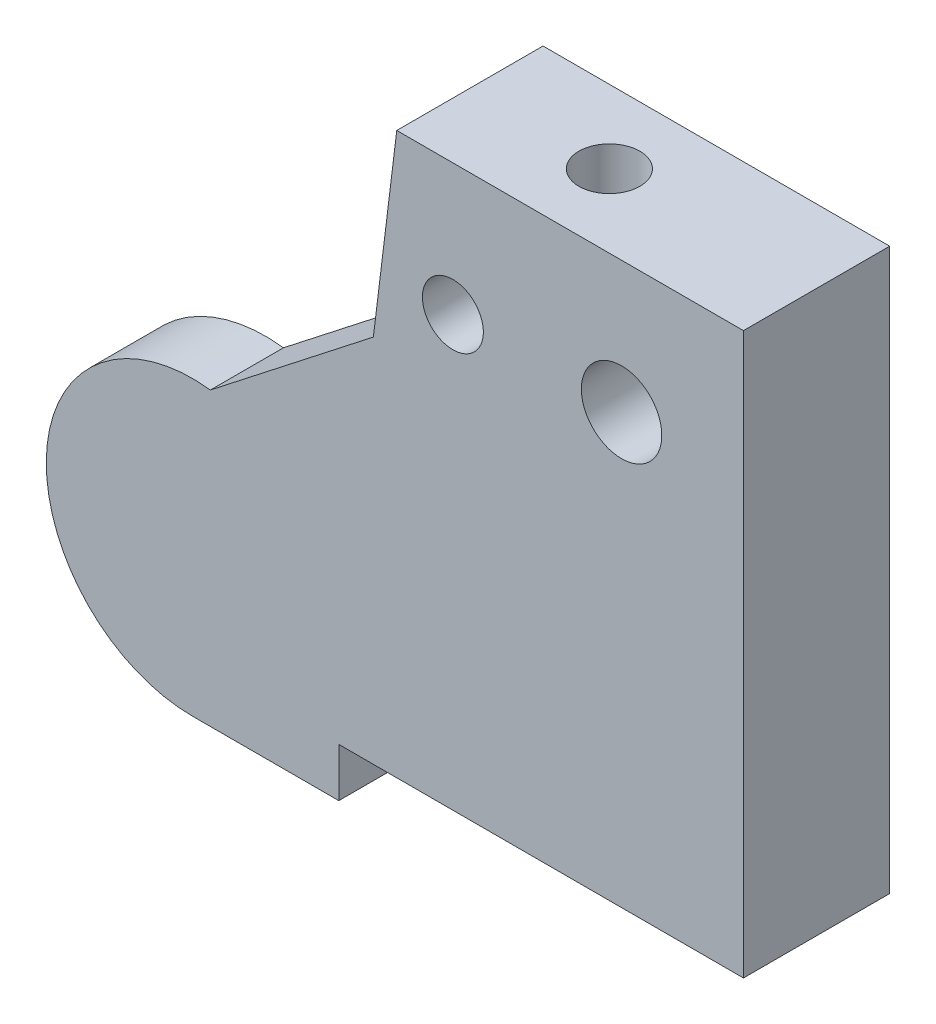
ISO-10303-21;
HEADER;
FILE_DESCRIPTION(('STEP AP214'),'2;1');
FILE_NAME('part.step','',(''),(''),'','','');
FILE_SCHEMA(('AUTOMOTIVE_DESIGN { 1 0 10303 214 1 1 1 1 }'));
ENDSEC;
DATA;
#1=APPLICATION_CONTEXT('core data for automotive mechanical design processes');
#2=APPLICATION_PROTOCOL_DEFINITION('international standard','automotive_design',2000,#1);
#3=PRODUCT_CONTEXT('',#1,'mechanical');
#4=PRODUCT('Part','Part','',(#3));
#5=PRODUCT_RELATED_PRODUCT_CATEGORY('part','',(#4));
#6=PRODUCT_DEFINITION_FORMATION('','',#4);
#7=PRODUCT_DEFINITION_CONTEXT('part definition',#1,'design');
#8=PRODUCT_DEFINITION('design','',#6,#7);
#9=PRODUCT_DEFINITION_SHAPE('','',#8);
#10=(LENGTH_UNIT() NAMED_UNIT(*) SI_UNIT(.MILLI.,.METRE.));
#11=(NAMED_UNIT(*) PLANE_ANGLE_UNIT() SI_UNIT($,.RADIAN.));
#12=(NAMED_UNIT(*) SI_UNIT($,.STERADIAN.) SOLID_ANGLE_UNIT());
#13=UNCERTAINTY_MEASURE_WITH_UNIT(LENGTH_MEASURE(1.E-05),#10,'distance_accuracy_value','');
#14=(GEOMETRIC_REPRESENTATION_CONTEXT(3) GLOBAL_UNCERTAINTY_ASSIGNED_CONTEXT((#13)) GLOBAL_UNIT_ASSIGNED_CONTEXT((#10,
#11,#12)) REPRESENTATION_CONTEXT('',''));
#15=CARTESIAN_POINT('',(0.,0.,0.));
#16=DIRECTION('',(0.,0.,1.));
#17=DIRECTION('',(1.,0.,0.));
#18=AXIS2_PLACEMENT_3D('',#15,#16,#17);
#19=CARTESIAN_POINT('',(0.,0.,9.));
#20=DIRECTION('',(0.,0.,-1.));
#21=DIRECTION('',(1.,0.,0.));
#22=AXIS2_PLACEMENT_3D('',#19,#20,#21);
#23=PLANE('',#22);
#24=CARTESIAN_POINT('',(-6.,4.,9.));
#25=DIRECTION('',(0.,0.,1.));
#26=DIRECTION('',(1.,0.,0.));
#27=AXIS2_PLACEMENT_3D('',#24,#25,#26);
#28=CIRCLE('',#27,6.);
#29=CARTESIAN_POINT('',(-6.,-2.,9.));
#30=VERTEX_POINT('',#29);
#31=CARTESIAN_POINT('',(-5.26878393956911,9.95527690984793,9.));
#32=VERTEX_POINT('',#31);
#33=EDGE_CURVE('E195',#30,#32,#28,.F.);
#34=ORIENTED_EDGE('',*,*,#33,.T.);
#35=DIRECTION('',(0.788010753606725,0.615661475325654,0.));
#36=VECTOR('',#35,1.);
#37=CARTESIAN_POINT('',(-5.26878393956915,9.95527690984794,9.));
#38=LINE('',#37,#36);
#39=CARTESIAN_POINT('',(1.41770903070971,15.179337759265,9.));
#40=VERTEX_POINT('',#39);
#41=EDGE_CURVE('E217',#32,#40,#38,.T.);
#42=ORIENTED_EDGE('',*,*,#41,.T.);
#43=DIRECTION('',(-0.121869343405148,-0.992546151641322,0.));
#44=VECTOR('',#43,1.);
#45=CARTESIAN_POINT('',(0.,3.6330242790971,9.));
#46=LINE('',#45,#44);
#47=CARTESIAN_POINT('',(0.,3.6330242790971,9.));
#48=VERTEX_POINT('',#47);
#49=EDGE_CURVE('E52',#40,#48,#46,.T.);
#50=ORIENTED_EDGE('',*,*,#49,.T.);
#51=DIRECTION('',(0.,-1.,0.));
#52=VECTOR('',#51,1.);
#53=CARTESIAN_POINT('',(0.,0.,9.));
#54=LINE('',#53,#52);
#55=CARTESIAN_POINT('',(0.,0.,9.));
#56=VERTEX_POINT('',#55);
#57=EDGE_CURVE('E202',#48,#56,#54,.T.);
#58=ORIENTED_EDGE('',*,*,#57,.T.);
#59=CARTESIAN_POINT('',(0.,-2.,9.));
#60=VERTEX_POINT('',#59);
#61=EDGE_CURVE('E201',#56,#60,#54,.T.);
#62=ORIENTED_EDGE('',*,*,#61,.T.);
#63=DIRECTION('',(-1.,0.,0.));
#64=VECTOR('',#63,1.);
#65=CARTESIAN_POINT('',(0.,-2.,9.));
#66=LINE('',#65,#64);
#67=EDGE_CURVE('E198',#60,#30,#66,.T.);
#68=ORIENTED_EDGE('',*,*,#67,.T.);
#69=EDGE_LOOP('',(#34,#42,#50,#58,#62,#68));
#70=FACE_BOUND('',#69,.T.);
#71=CARTESIAN_POINT('',(-6.,4.,9.));
#72=DIRECTION('',(0.,0.,-1.));
#73=DIRECTION('',(-1.,0.,0.));
#74=AXIS2_PLACEMENT_3D('',#71,#72,#73);
#75=CIRCLE('',#74,2.45);
#76=CARTESIAN_POINT('',(-8.45,4.,9.));
#77=VERTEX_POINT('',#76);
#78=EDGE_CURVE('E135',#77,#77,#75,.T.);
#79=ORIENTED_EDGE('',*,*,#78,.F.);
#80=EDGE_LOOP('',(#79));
#81=FACE_BOUND('',#80,.T.);
#82=ADVANCED_FACE('F37',(#70,#81),#23,.T.);
#83=CARTESIAN_POINT('',(0.,0.,12.));
#84=DIRECTION('',(0.,0.,-1.));
#85=DIRECTION('',(1.,0.,0.));
#86=AXIS2_PLACEMENT_3D('',#83,#84,#85);
#87=PLANE('',#86);
#88=CARTESIAN_POINT('',(11.6,17.6,12.));
#89=DIRECTION('',(0.,0.,-1.));
#90=DIRECTION('',(-1.,0.,0.));
#91=AXIS2_PLACEMENT_3D('',#88,#89,#90);
#92=CIRCLE('',#91,1.64999999999999);
#93=CARTESIAN_POINT('',(9.95,17.6,12.));
#94=VERTEX_POINT('',#93);
#95=EDGE_CURVE('E352',#94,#94,#92,.T.);
#96=ORIENTED_EDGE('',*,*,#95,.T.);
#97=EDGE_LOOP('',(#96));
#98=FACE_BOUND('',#97,.T.);
#99=DIRECTION('',(-0.121869343405148,-0.992546151641322,0.));
#100=VECTOR('',#99,1.);
#101=CARTESIAN_POINT('',(-0.439454060179395,0.0539581738161259,12.));
#102=LINE('',#101,#100);
#103=CARTESIAN_POINT('',(2.37796560990829,23.,12.));
#104=VERTEX_POINT('',#103);
#105=CARTESIAN_POINT('',(1.41770903070971,15.179337759265,12.));
#106=VERTEX_POINT('',#105);
#107=EDGE_CURVE('E153',#104,#106,#102,.T.);
#108=ORIENTED_EDGE('',*,*,#107,.T.);
#109=DIRECTION('',(-0.788010753606725,-0.615661475325654,0.));
#110=VECTOR('',#109,1.);
#111=CARTESIAN_POINT('',(-6.82685619046149,8.7379774551668,12.));
#112=LINE('',#111,#110);
#113=CARTESIAN_POINT('',(-5.26878393956911,9.95527690984793,12.));
#114=VERTEX_POINT('',#113);
#115=EDGE_CURVE('E219',#106,#114,#112,.T.);
#116=ORIENTED_EDGE('',*,*,#115,.T.);
#117=CARTESIAN_POINT('',(-6.,4.,12.));
#118=DIRECTION('',(0.,0.,1.));
#119=DIRECTION('',(1.,0.,0.));
#120=AXIS2_PLACEMENT_3D('',#117,#118,#119);
#121=CIRCLE('',#120,6.);
#122=CARTESIAN_POINT('',(-6.,-2.,12.));
#123=VERTEX_POINT('',#122);
#124=EDGE_CURVE('E194',#123,#114,#121,.F.);
#125=ORIENTED_EDGE('',*,*,#124,.F.);
#126=DIRECTION('',(-1.,0.,0.));
#127=VECTOR('',#126,1.);
#128=CARTESIAN_POINT('',(0.,-2.,12.));
#129=LINE('',#128,#127);
#130=CARTESIAN_POINT('',(0.,-2.,12.));
#131=VERTEX_POINT('',#130);
#132=EDGE_CURVE('E207',#131,#123,#129,.T.);
#133=ORIENTED_EDGE('',*,*,#132,.F.);
#134=DIRECTION('',(0.,-1.,0.));
#135=VECTOR('',#134,1.);
#136=CARTESIAN_POINT('',(0.,0.,12.));
#137=LINE('',#136,#135);
#138=CARTESIAN_POINT('',(0.,0.,12.));
#139=VERTEX_POINT('',#138);
#140=EDGE_CURVE('E199',#139,#131,#137,.T.);
#141=ORIENTED_EDGE('',*,*,#140,.F.);
#142=DIRECTION('',(1.,0.,0.));
#143=VECTOR('',#142,1.);
#144=CARTESIAN_POINT('',(0.,0.,12.));
#145=LINE('',#144,#143);
#146=CARTESIAN_POINT('',(16.6,0.,12.));
#147=VERTEX_POINT('',#146);
#148=EDGE_CURVE('E165',#139,#147,#145,.T.);
#149=ORIENTED_EDGE('',*,*,#148,.T.);
#150=DIRECTION('',(0.,1.,0.));
#151=VECTOR('',#150,1.);
#152=CARTESIAN_POINT('',(16.6,0.,12.));
#153=LINE('',#152,#151);
#154=CARTESIAN_POINT('',(16.6,23.,12.));
#155=VERTEX_POINT('',#154);
#156=EDGE_CURVE('E182',#147,#155,#153,.T.);
#157=ORIENTED_EDGE('',*,*,#156,.T.);
#158=DIRECTION('',(1.,0.,0.));
#159=VECTOR('',#158,1.);
#160=CARTESIAN_POINT('',(0.,23.,12.));
#161=LINE('',#160,#159);
#162=EDGE_CURVE('E171',#104,#155,#161,.T.);
#163=ORIENTED_EDGE('',*,*,#162,.F.);
#164=EDGE_LOOP('',(#108,#116,#125,#133,#141,#149,#157,#163));
#165=FACE_BOUND('',#164,.T.);
#166=CARTESIAN_POINT('',(4.68,17.61,12.));
#167=DIRECTION('',(0.,0.,-1.));
#168=DIRECTION('',(-1.,0.,0.));
#169=AXIS2_PLACEMENT_3D('',#166,#167,#168);
#170=CIRCLE('',#169,1.24999999999999);
#171=CARTESIAN_POINT('',(3.43000000000001,17.61,12.));
#172=VERTEX_POINT('',#171);
#173=EDGE_CURVE('E132',#172,#172,#170,.F.);
#174=ORIENTED_EDGE('',*,*,#173,.F.);
#175=EDGE_LOOP('',(#174));
#176=FACE_BOUND('',#175,.T.);
#177=ADVANCED_FACE('F238',(#98,#165,#176),#87,.F.);
#178=CARTESIAN_POINT('',(0.,0.,6.));
#179=DIRECTION('',(-1.,0.,0.));
#180=DIRECTION('',(0.,0.,-1.));
#181=AXIS2_PLACEMENT_3D('',#178,#179,#180);
#182=PLANE('',#181);
#183=DIRECTION('',(0.,0.,-1.));
#184=VECTOR('',#183,1.);
#185=CARTESIAN_POINT('',(0.,3.6330242790971,9.));
#186=LINE('',#185,#184);
#187=CARTESIAN_POINT('',(0.,3.6330242790971,6.));
#188=VERTEX_POINT('',#187);
#189=EDGE_CURVE('E162',#48,#188,#186,.T.);
#190=ORIENTED_EDGE('',*,*,#189,.T.);
#191=DIRECTION('',(0.,1.,0.));
#192=VECTOR('',#191,1.);
#193=CARTESIAN_POINT('',(0.,0.,6.));
#194=LINE('',#193,#192);
#195=CARTESIAN_POINT('',(0.,0.,6.));
#196=VERTEX_POINT('',#195);
#197=EDGE_CURVE('E176',#196,#188,#194,.T.);
#198=ORIENTED_EDGE('',*,*,#197,.F.);
#199=DIRECTION('',(0.,0.,1.));
#200=VECTOR('',#199,1.);
#201=CARTESIAN_POINT('',(0.,0.,6.));
#202=LINE('',#201,#200);
#203=EDGE_CURVE('E186',#196,#56,#202,.T.);
#204=ORIENTED_EDGE('',*,*,#203,.T.);
#205=ORIENTED_EDGE('',*,*,#57,.F.);
#206=EDGE_LOOP('',(#190,#198,#204,#205));
#207=FACE_BOUND('',#206,.T.);
#208=ADVANCED_FACE('F244',(#207),#182,.T.);
#209=CARTESIAN_POINT('',(0.,0.,9.));
#210=DIRECTION('',(1.,0.,0.));
#211=DIRECTION('',(0.,1.,0.));
#212=AXIS2_PLACEMENT_3D('',#209,#210,#211);
#213=PLANE('',#212);
#214=ORIENTED_EDGE('',*,*,#140,.T.);
#215=DIRECTION('',(0.,0.,1.));
#216=VECTOR('',#215,1.);
#217=CARTESIAN_POINT('',(0.,-2.,9.));
#218=LINE('',#217,#216);
#219=EDGE_CURVE('E204',#60,#131,#218,.T.);
#220=ORIENTED_EDGE('',*,*,#219,.F.);
#221=ORIENTED_EDGE('',*,*,#61,.F.);
#222=EDGE_CURVE('E179',#56,#139,#202,.T.);
#223=ORIENTED_EDGE('',*,*,#222,.T.);
#224=EDGE_LOOP('',(#214,#220,#221,#223));
#225=FACE_BOUND('',#224,.T.);
#226=ADVANCED_FACE('F252',(#225),#213,.T.);
#227=CARTESIAN_POINT('',(-6.,4.,9.));
#228=DIRECTION('',(0.,0.,1.));
#229=DIRECTION('',(-1.,0.,0.));
#230=AXIS2_PLACEMENT_3D('',#227,#228,#229);
#231=CYLINDRICAL_SURFACE('',#230,6.);
#232=ORIENTED_EDGE('',*,*,#124,.T.);
#233=DIRECTION('',(0.,0.,-1.));
#234=VECTOR('',#233,1.);
#235=CARTESIAN_POINT('',(-5.26878393956911,9.95527690984793,12.));
#236=LINE('',#235,#234);
#237=EDGE_CURVE('E155',#114,#32,#236,.T.);
#238=ORIENTED_EDGE('',*,*,#237,.T.);
#239=ORIENTED_EDGE('',*,*,#33,.F.);
#240=DIRECTION('',(0.,0.,1.));
#241=VECTOR('',#240,1.);
#242=CARTESIAN_POINT('',(-6.,-2.,9.));
#243=LINE('',#242,#241);
#244=EDGE_CURVE('E213',#30,#123,#243,.T.);
#245=ORIENTED_EDGE('',*,*,#244,.T.);
#246=EDGE_LOOP('',(#232,#238,#239,#245));
#247=FACE_BOUND('',#246,.T.);
#248=ADVANCED_FACE('F255',(#247),#231,.T.);
#249=CARTESIAN_POINT('',(0.,-2.,9.));
#250=DIRECTION('',(0.,-1.,0.));
#251=DIRECTION('',(1.,0.,0.));
#252=AXIS2_PLACEMENT_3D('',#249,#250,#251);
#253=PLANE('',#252);
#254=ORIENTED_EDGE('',*,*,#132,.T.);
#255=ORIENTED_EDGE('',*,*,#244,.F.);
#256=ORIENTED_EDGE('',*,*,#67,.F.);
#257=ORIENTED_EDGE('',*,*,#219,.T.);
#258=EDGE_LOOP('',(#254,#255,#256,#257));
#259=FACE_BOUND('',#258,.T.);
#260=ADVANCED_FACE('F257',(#259),#253,.T.);
#261=CARTESIAN_POINT('',(0.,0.,6.));
#262=DIRECTION('',(0.,1.,0.));
#263=DIRECTION('',(0.,0.,-1.));
#264=AXIS2_PLACEMENT_3D('',#261,#262,#263);
#265=PLANE('',#264);
#266=CARTESIAN_POINT('',(4.,0.,9.));
#267=DIRECTION('',(0.,-1.,0.));
#268=DIRECTION('',(0.,0.,-1.));
#269=AXIS2_PLACEMENT_3D('',#266,#267,#268);
#270=CIRCLE('',#269,1.24999999999999);
#271=CARTESIAN_POINT('',(4.,0.,7.75000000000001));
#272=VERTEX_POINT('',#271);
#273=EDGE_CURVE('E140',#272,#272,#270,.T.);
#274=ORIENTED_EDGE('',*,*,#273,.F.);
#275=EDGE_LOOP('',(#274));
#276=FACE_BOUND('',#275,.T.);
#277=CARTESIAN_POINT('',(12.6,0.,9.));
#278=DIRECTION('',(0.,-1.,0.));
#279=DIRECTION('',(0.,0.,-1.));
#280=AXIS2_PLACEMENT_3D('',#277,#278,#279);
#281=CIRCLE('',#280,1.24999999999999);
#282=CARTESIAN_POINT('',(12.6,0.,7.75000000000001));
#283=VERTEX_POINT('',#282);
#284=EDGE_CURVE('E147',#283,#283,#281,.T.);
#285=ORIENTED_EDGE('',*,*,#284,.F.);
#286=EDGE_LOOP('',(#285));
#287=FACE_BOUND('',#286,.T.);
#288=ORIENTED_EDGE('',*,*,#148,.F.);
#289=ORIENTED_EDGE('',*,*,#222,.F.);
#290=ORIENTED_EDGE('',*,*,#203,.F.);
#291=DIRECTION('',(1.,0.,0.));
#292=VECTOR('',#291,1.);
#293=CARTESIAN_POINT('',(0.,0.,6.));
#294=LINE('',#293,#292);
#295=CARTESIAN_POINT('',(16.6,0.,6.));
#296=VERTEX_POINT('',#295);
#297=EDGE_CURVE('E167',#196,#296,#294,.T.);
#298=ORIENTED_EDGE('',*,*,#297,.T.);
#299=DIRECTION('',(0.,0.,1.));
#300=VECTOR('',#299,1.);
#301=CARTESIAN_POINT('',(16.6,0.,6.));
#302=LINE('',#301,#300);
#303=EDGE_CURVE('E192',#296,#147,#302,.T.);
#304=ORIENTED_EDGE('',*,*,#303,.T.);
#305=EDGE_LOOP('',(#288,#289,#290,#298,#304));
#306=FACE_BOUND('',#305,.T.);
#307=ADVANCED_FACE('F249',(#276,#287,#306),#265,.F.);
#308=CARTESIAN_POINT('',(16.6,0.,6.));
#309=DIRECTION('',(-1.,0.,0.));
#310=DIRECTION('',(0.,-1.,0.));
#311=AXIS2_PLACEMENT_3D('',#308,#309,#310);
#312=PLANE('',#311);
#313=ORIENTED_EDGE('',*,*,#156,.F.);
#314=ORIENTED_EDGE('',*,*,#303,.F.);
#315=DIRECTION('',(0.,1.,0.));
#316=VECTOR('',#315,1.);
#317=CARTESIAN_POINT('',(16.6,0.,6.));
#318=LINE('',#317,#316);
#319=CARTESIAN_POINT('',(16.6,23.,6.));
#320=VERTEX_POINT('',#319);
#321=EDGE_CURVE('E170',#296,#320,#318,.T.);
#322=ORIENTED_EDGE('',*,*,#321,.T.);
#323=DIRECTION('',(0.,0.,1.));
#324=VECTOR('',#323,1.);
#325=CARTESIAN_POINT('',(16.6,23.,6.));
#326=LINE('',#325,#324);
#327=EDGE_CURVE('E189',#320,#155,#326,.T.);
#328=ORIENTED_EDGE('',*,*,#327,.T.);
#329=EDGE_LOOP('',(#313,#314,#322,#328));
#330=FACE_BOUND('',#329,.T.);
#331=ADVANCED_FACE('F297',(#330),#312,.F.);
#332=CARTESIAN_POINT('',(0.,23.,6.));
#333=DIRECTION('',(0.,1.,0.));
#334=DIRECTION('',(0.,0.,-1.));
#335=AXIS2_PLACEMENT_3D('',#332,#333,#334);
#336=PLANE('',#335);
#337=CARTESIAN_POINT('',(8.1,23.,9.));
#338=DIRECTION('',(0.,1.,0.));
#339=DIRECTION('',(0.,0.,1.));
#340=AXIS2_PLACEMENT_3D('',#337,#338,#339);
#341=CIRCLE('',#340,1.24999999999999);
#342=CARTESIAN_POINT('',(8.1,23.,10.25));
#343=VERTEX_POINT('',#342);
#344=EDGE_CURVE('E129',#343,#343,#341,.T.);
#345=ORIENTED_EDGE('',*,*,#344,.F.);
#346=EDGE_LOOP('',(#345));
#347=FACE_BOUND('',#346,.T.);
#348=DIRECTION('',(0.,0.,-1.));
#349=VECTOR('',#348,1.);
#350=CARTESIAN_POINT('',(2.37796560990829,23.,9.));
#351=LINE('',#350,#349);
#352=CARTESIAN_POINT('',(2.37796560990829,23.,6.));
#353=VERTEX_POINT('',#352);
#354=EDGE_CURVE('E160',#104,#353,#351,.T.);
#355=ORIENTED_EDGE('',*,*,#354,.F.);
#356=ORIENTED_EDGE('',*,*,#162,.T.);
#357=ORIENTED_EDGE('',*,*,#327,.F.);
#358=DIRECTION('',(1.,0.,0.));
#359=VECTOR('',#358,1.);
#360=CARTESIAN_POINT('',(0.,23.,6.));
#361=LINE('',#360,#359);
#362=EDGE_CURVE('E174',#353,#320,#361,.T.);
#363=ORIENTED_EDGE('',*,*,#362,.F.);
#364=EDGE_LOOP('',(#355,#356,#357,#363));
#365=FACE_BOUND('',#364,.T.);
#366=ADVANCED_FACE('F300',(#347,#365),#336,.T.);
#367=CARTESIAN_POINT('',(0.,0.,6.));
#368=DIRECTION('',(0.,0.,-1.));
#369=DIRECTION('',(1.,0.,0.));
#370=AXIS2_PLACEMENT_3D('',#367,#368,#369);
#371=PLANE('',#370);
#372=CARTESIAN_POINT('',(11.6,17.6,6.));
#373=DIRECTION('',(0.,0.,-1.));
#374=DIRECTION('',(-1.,0.,0.));
#375=AXIS2_PLACEMENT_3D('',#372,#373,#374);
#376=CIRCLE('',#375,1.64999999999999);
#377=CARTESIAN_POINT('',(9.95000000000001,17.6,6.));
#378=VERTEX_POINT('',#377);
#379=EDGE_CURVE('E354',#378,#378,#376,.T.);
#380=ORIENTED_EDGE('',*,*,#379,.F.);
#381=EDGE_LOOP('',(#380));
#382=FACE_BOUND('',#381,.T.);
#383=CARTESIAN_POINT('',(4.68,17.61,6.));
#384=DIRECTION('',(0.,0.,-1.));
#385=DIRECTION('',(-1.,0.,0.));
#386=AXIS2_PLACEMENT_3D('',#383,#384,#385);
#387=CIRCLE('',#386,1.24999999999999);
#388=CARTESIAN_POINT('',(3.43000000000001,17.61,6.));
#389=VERTEX_POINT('',#388);
#390=EDGE_CURVE('E128',#389,#389,#387,.T.);
#391=ORIENTED_EDGE('',*,*,#390,.F.);
#392=EDGE_LOOP('',(#391));
#393=FACE_BOUND('',#392,.T.);
#394=DIRECTION('',(-0.121869343405148,-0.992546151641322,0.));
#395=VECTOR('',#394,1.);
#396=CARTESIAN_POINT('',(0.,3.6330242790971,6.));
#397=LINE('',#396,#395);
#398=EDGE_CURVE('E158',#353,#188,#397,.T.);
#399=ORIENTED_EDGE('',*,*,#398,.F.);
#400=ORIENTED_EDGE('',*,*,#362,.T.);
#401=ORIENTED_EDGE('',*,*,#321,.F.);
#402=ORIENTED_EDGE('',*,*,#297,.F.);
#403=ORIENTED_EDGE('',*,*,#197,.T.);
#404=EDGE_LOOP('',(#399,#400,#401,#402,#403));
#405=FACE_BOUND('',#404,.T.);
#406=ADVANCED_FACE('F275',(#382,#393,#405),#371,.T.);
#407=CARTESIAN_POINT('',(0.,3.6330242790971,9.));
#408=DIRECTION('',(0.992546151641322,-0.121869343405148,0.));
#409=DIRECTION('',(0.121869343405148,0.992546151641322,0.));
#410=AXIS2_PLACEMENT_3D('',#407,#408,#409);
#411=PLANE('',#410);
#412=ORIENTED_EDGE('',*,*,#49,.F.);
#413=DIRECTION('',(0.,0.,1.));
#414=VECTOR('',#413,1.);
#415=CARTESIAN_POINT('',(1.41770903070971,15.1793377592649,9.));
#416=LINE('',#415,#414);
#417=EDGE_CURVE('E57',#40,#106,#416,.T.);
#418=ORIENTED_EDGE('',*,*,#417,.T.);
#419=ORIENTED_EDGE('',*,*,#107,.F.);
#420=ORIENTED_EDGE('',*,*,#354,.T.);
#421=ORIENTED_EDGE('',*,*,#398,.T.);
#422=ORIENTED_EDGE('',*,*,#189,.F.);
#423=EDGE_LOOP('',(#412,#418,#419,#420,#421,#422));
#424=FACE_BOUND('',#423,.T.);
#425=ADVANCED_FACE('F266',(#424),#411,.F.);
#426=CARTESIAN_POINT('',(-5.26878393956915,9.95527690984794,12.));
#427=DIRECTION('',(0.615661475325654,-0.788010753606725,0.));
#428=DIRECTION('',(0.,0.,-1.));
#429=AXIS2_PLACEMENT_3D('',#426,#427,#428);
#430=PLANE('',#429);
#431=ORIENTED_EDGE('',*,*,#115,.F.);
#432=ORIENTED_EDGE('',*,*,#417,.F.);
#433=ORIENTED_EDGE('',*,*,#41,.F.);
#434=ORIENTED_EDGE('',*,*,#237,.F.);
#435=EDGE_LOOP('',(#431,#432,#433,#434));
#436=FACE_BOUND('',#435,.T.);
#437=ADVANCED_FACE('F263',(#436),#430,.F.);
#438=CARTESIAN_POINT('',(12.6,8.49999999999999,9.));
#439=DIRECTION('',(0.,-1.,0.));
#440=DIRECTION('',(0.,0.,-1.));
#441=AXIS2_PLACEMENT_3D('',#438,#439,#440);
#442=CONICAL_SURFACE('',#441,1.24999999999999,1.02974425867665);
#443=CARTESIAN_POINT('',(12.6,9.25107577378444,9.));
#444=VERTEX_POINT('',#443);
#445=VERTEX_LOOP('',#444);
#446=FACE_BOUND('',#445,.T.);
#447=CARTESIAN_POINT('',(12.6,8.49999999999999,9.));
#448=DIRECTION('',(0.,-1.,0.));
#449=DIRECTION('',(0.,0.,-1.));
#450=AXIS2_PLACEMENT_3D('',#447,#448,#449);
#451=CIRCLE('',#450,1.24999999999999);
#452=CARTESIAN_POINT('',(12.6,8.49999999999999,7.75000000000001));
#453=VERTEX_POINT('',#452);
#454=EDGE_CURVE('E150',#453,#453,#451,.T.);
#455=ORIENTED_EDGE('',*,*,#454,.T.);
#456=EDGE_LOOP('',(#455));
#457=FACE_BOUND('',#456,.T.);
#458=ADVANCED_FACE('F265',(#446,#457),#442,.F.);
#459=CARTESIAN_POINT('',(12.6,0.,9.));
#460=DIRECTION('',(0.,-1.,0.));
#461=DIRECTION('',(0.,0.,-1.));
#462=AXIS2_PLACEMENT_3D('',#459,#460,#461);
#463=CYLINDRICAL_SURFACE('',#462,1.24999999999999);
#464=ORIENTED_EDGE('',*,*,#454,.F.);
#465=EDGE_LOOP('',(#464));
#466=FACE_BOUND('',#465,.T.);
#467=ORIENTED_EDGE('',*,*,#284,.T.);
#468=EDGE_LOOP('',(#467));
#469=FACE_BOUND('',#468,.T.);
#470=ADVANCED_FACE('F272',(#466,#469),#463,.F.);
#471=CARTESIAN_POINT('',(4.,8.49999999999999,9.));
#472=DIRECTION('',(0.,-1.,0.));
#473=DIRECTION('',(0.,0.,-1.));
#474=AXIS2_PLACEMENT_3D('',#471,#472,#473);
#475=CONICAL_SURFACE('',#474,1.24999999999999,1.02974425867665);
#476=CARTESIAN_POINT('',(4.,9.25107577378444,9.));
#477=VERTEX_POINT('',#476);
#478=VERTEX_LOOP('',#477);
#479=FACE_BOUND('',#478,.T.);
#480=CARTESIAN_POINT('',(4.,8.49999999999999,9.));
#481=DIRECTION('',(0.,-1.,0.));
#482=DIRECTION('',(0.,0.,-1.));
#483=AXIS2_PLACEMENT_3D('',#480,#481,#482);
#484=CIRCLE('',#483,1.24999999999999);
#485=CARTESIAN_POINT('',(4.,8.49999999999999,7.75000000000001));
#486=VERTEX_POINT('',#485);
#487=EDGE_CURVE('E144',#486,#486,#484,.T.);
#488=ORIENTED_EDGE('',*,*,#487,.T.);
#489=EDGE_LOOP('',(#488));
#490=FACE_BOUND('',#489,.T.);
#491=ADVANCED_FACE('F326',(#479,#490),#475,.F.);
#492=CARTESIAN_POINT('',(4.,0.,9.));
#493=DIRECTION('',(0.,-1.,0.));
#494=DIRECTION('',(0.,0.,-1.));
#495=AXIS2_PLACEMENT_3D('',#492,#493,#494);
#496=CYLINDRICAL_SURFACE('',#495,1.24999999999999);
#497=ORIENTED_EDGE('',*,*,#487,.F.);
#498=EDGE_LOOP('',(#497));
#499=FACE_BOUND('',#498,.T.);
#500=ORIENTED_EDGE('',*,*,#273,.T.);
#501=EDGE_LOOP('',(#500));
#502=FACE_BOUND('',#501,.T.);
#503=ADVANCED_FACE('F332',(#499,#502),#496,.F.);
#504=CARTESIAN_POINT('',(4.68,17.61,6.));
#505=DIRECTION('',(0.,0.,-1.));
#506=DIRECTION('',(-1.,0.,0.));
#507=AXIS2_PLACEMENT_3D('',#504,#505,#506);
#508=CYLINDRICAL_SURFACE('',#507,1.24999999999999);
#509=ORIENTED_EDGE('',*,*,#173,.T.);
#510=EDGE_LOOP('',(#509));
#511=FACE_BOUND('',#510,.T.);
#512=ORIENTED_EDGE('',*,*,#390,.T.);
#513=EDGE_LOOP('',(#512));
#514=FACE_BOUND('',#513,.T.);
#515=ADVANCED_FACE('F122',(#511,#514),#508,.F.);
#516=CARTESIAN_POINT('',(8.1,20.,9.));
#517=DIRECTION('',(0.,1.,0.));
#518=DIRECTION('',(0.,0.,1.));
#519=AXIS2_PLACEMENT_3D('',#516,#517,#518);
#520=CONICAL_SURFACE('',#519,1.25,1.02974425867665);
#521=CARTESIAN_POINT('',(8.09999999999999,19.2489242262155,9.));
#522=VERTEX_POINT('',#521);
#523=VERTEX_LOOP('',#522);
#524=FACE_BOUND('',#523,.T.);
#525=CARTESIAN_POINT('',(8.1,20.,9.));
#526=DIRECTION('',(0.,1.,0.));
#527=DIRECTION('',(0.,0.,1.));
#528=AXIS2_PLACEMENT_3D('',#525,#526,#527);
#529=CIRCLE('',#528,1.25);
#530=CARTESIAN_POINT('',(8.1,20.,10.25));
#531=VERTEX_POINT('',#530);
#532=EDGE_CURVE('E126',#531,#531,#529,.T.);
#533=ORIENTED_EDGE('',*,*,#532,.T.);
#534=EDGE_LOOP('',(#533));
#535=FACE_BOUND('',#534,.T.);
#536=ADVANCED_FACE('F118',(#524,#535),#520,.F.);
#537=CARTESIAN_POINT('',(8.1,23.,9.));
#538=DIRECTION('',(0.,1.,0.));
#539=DIRECTION('',(0.,0.,1.));
#540=AXIS2_PLACEMENT_3D('',#537,#538,#539);
#541=CYLINDRICAL_SURFACE('',#540,1.24999999999999);
#542=ORIENTED_EDGE('',*,*,#532,.F.);
#543=EDGE_LOOP('',(#542));
#544=FACE_BOUND('',#543,.T.);
#545=ORIENTED_EDGE('',*,*,#344,.T.);
#546=EDGE_LOOP('',(#545));
#547=FACE_BOUND('',#546,.T.);
#548=ADVANCED_FACE('F121',(#544,#547),#541,.F.);
#549=CARTESIAN_POINT('',(-6.,4.,5.5));
#550=DIRECTION('',(0.,0.,1.));
#551=DIRECTION('',(1.,0.,0.));
#552=AXIS2_PLACEMENT_3D('',#549,#550,#551);
#553=CYLINDRICAL_SURFACE('',#552,2.45);
#554=CARTESIAN_POINT('',(-6.,4.,6.));
#555=DIRECTION('',(0.,0.,-1.));
#556=DIRECTION('',(-1.,0.,0.));
#557=AXIS2_PLACEMENT_3D('',#554,#555,#556);
#558=CIRCLE('',#557,2.45);
#559=CARTESIAN_POINT('',(-8.45,4.,6.));
#560=VERTEX_POINT('',#559);
#561=EDGE_CURVE('E11',#560,#560,#558,.F.);
#562=ORIENTED_EDGE('',*,*,#561,.T.);
#563=EDGE_LOOP('',(#562));
#564=FACE_BOUND('',#563,.T.);
#565=ORIENTED_EDGE('',*,*,#78,.T.);
#566=EDGE_LOOP('',(#565));
#567=FACE_BOUND('',#566,.T.);
#568=ADVANCED_FACE('F234',(#564,#567),#553,.T.);
#569=CARTESIAN_POINT('',(-6.,4.,5.5));
#570=DIRECTION('',(0.,0.,-1.));
#571=DIRECTION('',(-1.,0.,0.));
#572=AXIS2_PLACEMENT_3D('',#569,#570,#571);
#573=PLANE('',#572);
#574=CARTESIAN_POINT('',(-6.,4.,5.5));
#575=DIRECTION('',(0.,0.,-1.));
#576=DIRECTION('',(-1.,0.,0.));
#577=AXIS2_PLACEMENT_3D('',#574,#575,#576);
#578=CIRCLE('',#577,1.95000000000001);
#579=CARTESIAN_POINT('',(-7.95000000000001,4.,5.5));
#580=VERTEX_POINT('',#579);
#581=EDGE_CURVE('E45',#580,#580,#578,.T.);
#582=ORIENTED_EDGE('',*,*,#581,.T.);
#583=EDGE_LOOP('',(#582));
#584=FACE_BOUND('',#583,.T.);
#585=ADVANCED_FACE('F223',(#584),#573,.T.);
#586=CARTESIAN_POINT('',(-6.,4.,5.5));
#587=DIRECTION('',(0.,0.,1.));
#588=DIRECTION('',(1.,0.,0.));
#589=AXIS2_PLACEMENT_3D('',#586,#587,#588);
#590=CONICAL_SURFACE('',#589,1.95000000000001,0.785398163397443);
#591=ORIENTED_EDGE('',*,*,#561,.F.);
#592=EDGE_LOOP('',(#591));
#593=FACE_BOUND('',#592,.T.);
#594=ORIENTED_EDGE('',*,*,#581,.F.);
#595=EDGE_LOOP('',(#594));
#596=FACE_BOUND('',#595,.T.);
#597=ADVANCED_FACE('F39',(#593,#596),#590,.T.);
#598=CARTESIAN_POINT('',(11.6,17.6,6.));
#599=DIRECTION('',(0.,0.,-1.));
#600=DIRECTION('',(-1.,0.,0.));
#601=AXIS2_PLACEMENT_3D('',#598,#599,#600);
#602=CYLINDRICAL_SURFACE('',#601,1.64999999999999);
#603=ORIENTED_EDGE('',*,*,#379,.T.);
#604=EDGE_LOOP('',(#603));
#605=FACE_BOUND('',#604,.T.);
#606=ORIENTED_EDGE('',*,*,#95,.F.);
#607=EDGE_LOOP('',(#606));
#608=FACE_BOUND('',#607,.T.);
#609=ADVANCED_FACE('F226',(#605,#608),#602,.F.);
#610=CLOSED_SHELL('',(#82,#177,#208,#226,#248,#260,#307,#331,#366,#406,#425,#437,#458,#470,#491,
#503,#515,#536,#548,#568,#585,#597,#609));
#611=MANIFOLD_SOLID_BREP('B2',#610);
#612=ADVANCED_BREP_SHAPE_REPRESENTATION('',(#18,#611),#14);
#613=SHAPE_DEFINITION_REPRESENTATION(#9,#612);
ENDSEC;
END-ISO-10303-21;
